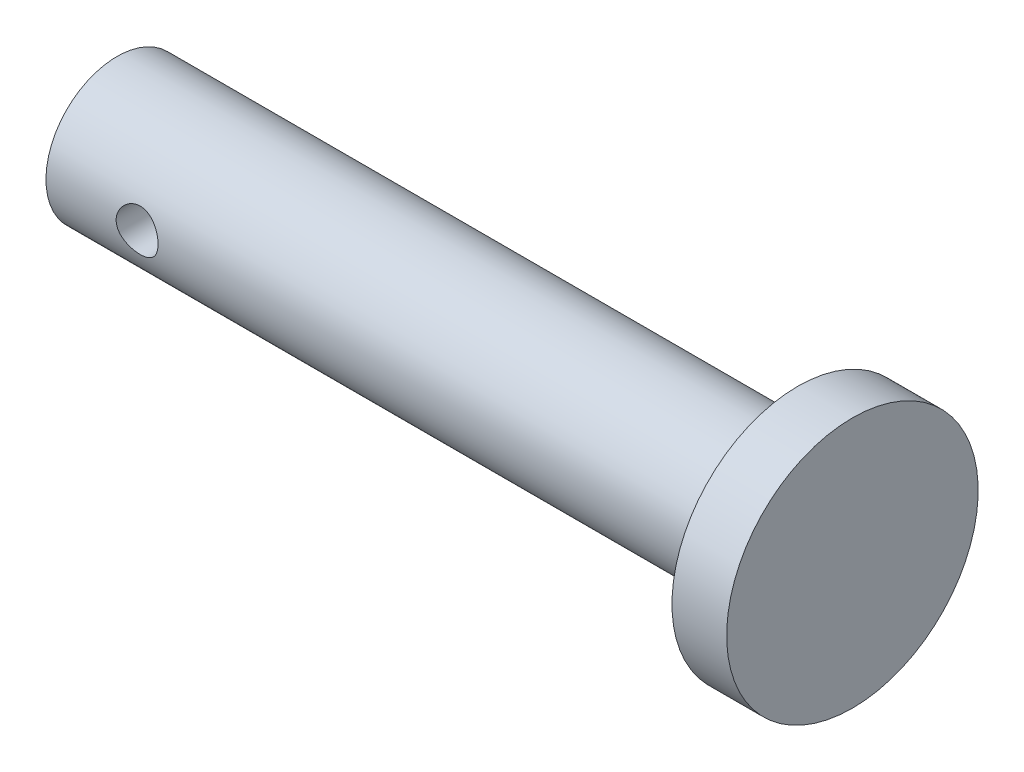
ISO-10303-21;
HEADER;
FILE_DESCRIPTION(('STEP AP214'),'2;1');
FILE_NAME('part.step','',(''),(''),'','','');
FILE_SCHEMA(('AUTOMOTIVE_DESIGN { 1 0 10303 214 1 1 1 1 }'));
ENDSEC;
DATA;
#1=APPLICATION_CONTEXT('core data for automotive mechanical design processes');
#2=APPLICATION_PROTOCOL_DEFINITION('international standard','automotive_design',2000,#1);
#3=PRODUCT_CONTEXT('',#1,'mechanical');
#4=PRODUCT('Part','Part','',(#3));
#5=PRODUCT_RELATED_PRODUCT_CATEGORY('part','',(#4));
#6=PRODUCT_DEFINITION_FORMATION('','',#4);
#7=PRODUCT_DEFINITION_CONTEXT('part definition',#1,'design');
#8=PRODUCT_DEFINITION('design','',#6,#7);
#9=PRODUCT_DEFINITION_SHAPE('','',#8);
#10=(LENGTH_UNIT() NAMED_UNIT(*) SI_UNIT(.MILLI.,.METRE.));
#11=(NAMED_UNIT(*) PLANE_ANGLE_UNIT() SI_UNIT($,.RADIAN.));
#12=(NAMED_UNIT(*) SI_UNIT($,.STERADIAN.) SOLID_ANGLE_UNIT());
#13=UNCERTAINTY_MEASURE_WITH_UNIT(LENGTH_MEASURE(1.E-05),#10,'distance_accuracy_value','');
#14=(GEOMETRIC_REPRESENTATION_CONTEXT(3) GLOBAL_UNCERTAINTY_ASSIGNED_CONTEXT((#13)) GLOBAL_UNIT_ASSIGNED_CONTEXT((#10,
#11,#12)) REPRESENTATION_CONTEXT('',''));
#15=CARTESIAN_POINT('',(0.,0.,0.));
#16=DIRECTION('',(0.,0.,1.));
#17=DIRECTION('',(1.,0.,0.));
#18=AXIS2_PLACEMENT_3D('',#15,#16,#17);
#19=CARTESIAN_POINT('',(-18.675,0.,0.));
#20=DIRECTION('',(-1.,0.,0.));
#21=DIRECTION('',(0.,-1.,0.));
#22=AXIS2_PLACEMENT_3D('',#19,#20,#21);
#23=PLANE('',#22);
#24=CARTESIAN_POINT('',(-18.675,0.,0.));
#25=DIRECTION('',(-1.,0.,0.));
#26=DIRECTION('',(0.,-1.,0.));
#27=AXIS2_PLACEMENT_3D('',#24,#25,#26);
#28=CIRCLE('',#27,3.9);
#29=CARTESIAN_POINT('',(-18.675,-3.9,0.));
#30=VERTEX_POINT('',#29);
#31=EDGE_CURVE('E12',#30,#30,#28,.T.);
#32=ORIENTED_EDGE('',*,*,#31,.T.);
#33=EDGE_LOOP('',(#32));
#34=FACE_BOUND('',#33,.T.);
#35=ADVANCED_FACE('F51',(#34),#23,.T.);
#36=CARTESIAN_POINT('',(-18.675,0.,0.));
#37=DIRECTION('',(-1.,0.,0.));
#38=DIRECTION('',(0.,-1.,0.));
#39=AXIS2_PLACEMENT_3D('',#36,#37,#38);
#40=CYLINDRICAL_SURFACE('',#39,3.9);
#41=CARTESIAN_POINT('',(-12.525,0.,-3.9));
#42=CARTESIAN_POINT('',(-12.5250008968316,-0.0631374782315801,-3.89999937647246));
#43=CARTESIAN_POINT('',(-12.5302168498043,-0.1262840563774,-3.89845206413463));
#44=CARTESIAN_POINT('',(-12.5508953722315,-0.250741476835077,-3.89243053997196));
#45=CARTESIAN_POINT('',(-12.5663612954919,-0.312051711427401,-3.88795537015381));
#46=CARTESIAN_POINT('',(-12.606980772424,-0.431023152180485,-3.87656906770976));
#47=CARTESIAN_POINT('',(-12.6321203177736,-0.488689495108532,-3.86966145870838));
#48=CARTESIAN_POINT('',(-12.6913168464166,-0.598988339996717,-3.85413015735305));
#49=CARTESIAN_POINT('',(-12.7253749253311,-0.651620222399713,-3.84550625418759));
#50=CARTESIAN_POINT('',(-12.8024409145422,-0.75182102249986,-3.82719564289787));
#51=CARTESIAN_POINT('',(-12.8456517308289,-0.799229996730766,-3.81748771569521));
#52=CARTESIAN_POINT('',(-12.9393639463116,-0.886244437812663,-3.79823128727195));
#53=CARTESIAN_POINT('',(-12.9898665202255,-0.925848644862781,-3.78868281201646));
#54=CARTESIAN_POINT('',(-13.098069604138,-0.996960920412011,-3.77060314442044));
#55=CARTESIAN_POINT('',(-13.1559020536166,-1.02827558268509,-3.76209838789334));
#56=CARTESIAN_POINT('',(-13.2763032756927,-1.08067034920287,-3.74738541998928));
#57=CARTESIAN_POINT('',(-13.3388709505136,-1.10175281724697,-3.7411766782754));
#58=CARTESIAN_POINT('',(-13.4651742702842,-1.13251140043501,-3.73197951302094));
#59=CARTESIAN_POINT('',(-13.5288320980852,-1.14248162784549,-3.72890824283298));
#60=CARTESIAN_POINT('',(-13.6569852898076,-1.15165090337876,-3.72608712458471));
#61=CARTESIAN_POINT('',(-13.7214804550077,-1.15085246212836,-3.72633650234237));
#62=CARTESIAN_POINT('',(-13.847101756818,-1.13873847302781,-3.73005496042293));
#63=CARTESIAN_POINT('',(-13.9082670909178,-1.12778930476266,-3.73341187148709));
#64=CARTESIAN_POINT('',(-14.0278510400984,-1.09627578796794,-3.7427859905035));
#65=CARTESIAN_POINT('',(-14.0862693918104,-1.07571051954829,-3.74880345296496));
#66=CARTESIAN_POINT('',(-14.1996066435939,-1.02527418871665,-3.76291161584599));
#67=CARTESIAN_POINT('',(-14.2544685386195,-0.995282774015666,-3.77102887461452));
#68=CARTESIAN_POINT('',(-14.3585046138267,-0.926929185445069,-3.7884090133638));
#69=CARTESIAN_POINT('',(-14.4076774518711,-0.888565042454943,-3.79767216261577));
#70=CARTESIAN_POINT('',(-14.5010201771127,-0.802726738929585,-3.81675721782381));
#71=CARTESIAN_POINT('',(-14.5449088431565,-0.754947925319673,-3.82658660290396));
#72=CARTESIAN_POINT('',(-14.6241150058416,-0.652586172592414,-3.84536541487498));
#73=CARTESIAN_POINT('',(-14.6594319988326,-0.598002833943187,-3.85431479004029));
#74=CARTESIAN_POINT('',(-14.7206553049053,-0.483082586554351,-3.87040231728269));
#75=CARTESIAN_POINT('',(-14.7465010912981,-0.422711680191325,-3.87752873514172));
#76=CARTESIAN_POINT('',(-14.787590357054,-0.298221428159156,-3.88908284633983));
#77=CARTESIAN_POINT('',(-14.8028366895819,-0.234103096265121,-3.89351126588735));
#78=CARTESIAN_POINT('',(-14.8218303833929,-0.106330274604508,-3.89905635830308));
#79=CARTESIAN_POINT('',(-14.8259590646657,-0.0427371473976157,-3.90028280753208));
#80=CARTESIAN_POINT('',(-14.8236665138623,0.0842365312209821,-3.89960679434886));
#81=CARTESIAN_POINT('',(-14.8172466378782,0.147617108907844,-3.89770473412873));
#82=CARTESIAN_POINT('',(-14.7943483396063,0.270939904685514,-3.89105714923803));
#83=CARTESIAN_POINT('',(-14.7780911043642,0.330926882810402,-3.88637419327162));
#84=CARTESIAN_POINT('',(-14.7362441925676,0.447310049477916,-3.87470480893401));
#85=CARTESIAN_POINT('',(-14.7106534086169,0.503705811001051,-3.86771810724012));
#86=CARTESIAN_POINT('',(-14.6502150905663,0.612721454601223,-3.8519704746757));
#87=CARTESIAN_POINT('',(-14.6151713598495,0.665227146489711,-3.84317300308412));
#88=CARTESIAN_POINT('',(-14.5370615860421,0.763743255455843,-3.8248152332649));
#89=CARTESIAN_POINT('',(-14.4939935992274,0.80975209403694,-3.81525475053371));
#90=CARTESIAN_POINT('',(-14.3992676132904,0.895636304747585,-3.7960298269253));
#91=CARTESIAN_POINT('',(-14.3473617261096,0.93524065158333,-3.7863734586898));
#92=CARTESIAN_POINT('',(-14.2374313450957,1.00519385423065,-3.76840740705703));
#93=CARTESIAN_POINT('',(-14.179407032877,1.03554298466269,-3.76009768370557));
#94=CARTESIAN_POINT('',(-14.0590937160704,1.08591088927195,-3.74586217719055));
#95=CARTESIAN_POINT('',(-13.9968274427931,1.10598046799836,-3.73992470237802));
#96=CARTESIAN_POINT('',(-13.8695926533263,1.13529378705524,-3.73113209936963));
#97=CARTESIAN_POINT('',(-13.8046250307892,1.14454107853738,-3.72827596010935));
#98=CARTESIAN_POINT('',(-13.6766404101873,1.15171156470793,-3.72606666169847));
#99=CARTESIAN_POINT('',(-13.6136501288788,1.15007550141294,-3.7265771569012));
#100=CARTESIAN_POINT('',(-13.4888855215509,1.13657300584075,-3.73071716639397));
#101=CARTESIAN_POINT('',(-13.4271111499653,1.12470695768139,-3.73434656357474));
#102=CARTESIAN_POINT('',(-13.3072255716215,1.09136145575474,-3.74422555432673));
#103=CARTESIAN_POINT('',(-13.249080221795,1.06999494893524,-3.75044431044196));
#104=CARTESIAN_POINT('',(-13.1371533015327,1.01834271032695,-3.76479659206304));
#105=CARTESIAN_POINT('',(-13.0833725464559,0.988055316878852,-3.7729304742354));
#106=CARTESIAN_POINT('',(-12.9796466434408,0.918167414296003,-3.79055524386233));
#107=CARTESIAN_POINT('',(-12.9299041336743,0.878275681014946,-3.8000839211764));
#108=CARTESIAN_POINT('',(-12.8376763556955,0.790840400324018,-3.81923701348264));
#109=CARTESIAN_POINT('',(-12.7951929543141,0.743294890673285,-3.82886145243051));
#110=CARTESIAN_POINT('',(-12.7175099884599,0.640302818942885,-3.84744359812366));
#111=CARTESIAN_POINT('',(-12.6825468129365,0.584672772834722,-3.85637519876255));
#112=CARTESIAN_POINT('',(-12.6225198156866,0.468060579348602,-3.87225679535396));
#113=CARTESIAN_POINT('',(-12.5974510765133,0.407081109052212,-3.87920777517854));
#114=CARTESIAN_POINT('',(-12.5603397555691,0.288818906202192,-3.88969020624806));
#115=CARTESIAN_POINT('',(-12.5471223925053,0.231929447719438,-3.89352505905264));
#116=CARTESIAN_POINT('',(-12.5294527768816,0.116695766386291,-3.89868004994844));
#117=CARTESIAN_POINT('',(-12.5249991711467,0.0583517695341206,-3.90000057626526));
#118=CARTESIAN_POINT('',(-12.525,0.,-3.9));
#119=B_SPLINE_CURVE_WITH_KNOTS('',3,(#41,#42,#43,#44,#45,#46,#47,#48,#49,#50,#51,#52,#53,#54,
#55,#56,#57,#58,#59,#60,#61,#62,#63,#64,#65,#66,#67,#68,#69,#70,#71,#72,#73,#74,#75,#76,#77,#78,
#79,#80,#81,#82,#83,#84,#85,#86,#87,#88,#89,#90,#91,#92,#93,#94,#95,#96,#97,#98,#99,#100,#101,
#102,#103,#104,#105,#106,#107,#108,#109,#110,#111,#112,#113,#114,#115,#116,#117,#118),
.UNSPECIFIED.,.T.,.F.,(4,2,2,2,2,2,2,2,2,2,2,2,2,2,2,2,2,2,2,2,2,2,2,2,2,2,2,2,2,2,2,2,2,2,2,2,
2,2,4),(0.,0.189198152270444,0.378458241050166,0.567445288438785,0.756455563349068,
0.950202743995578,1.14398117263433,1.34194624069882,1.53986555389362,1.73241193352215,
1.92491342331717,2.11072647022677,2.2965572959196,2.48486440358068,2.67321584562403,
2.86915241171192,3.06510048775939,3.26227980916675,3.4594060331996,3.64967944633797,
3.83992840039078,4.02605091156304,4.21219551277049,4.40254847143273,4.59294759958346,
4.79001055760107,4.98706766780436,5.18314123176826,5.37915043943247,5.56727160466128,
5.75538570658066,5.94132082860648,6.1272906059795,6.31983061166789,6.51242005874601,
6.71038475402325,6.90825093834658,7.08313521201907,7.25799248042426),.UNSPECIFIED.);
#120=CARTESIAN_POINT('',(-12.525,0.,-3.9));
#121=VERTEX_POINT('',#120);
#122=EDGE_CURVE('E58',#121,#121,#119,.T.);
#123=ORIENTED_EDGE('',*,*,#122,.F.);
#124=EDGE_LOOP('',(#123));
#125=FACE_BOUND('',#124,.T.);
#126=CARTESIAN_POINT('',(-12.525,0.,3.90000000000001));
#127=CARTESIAN_POINT('',(-12.5250008968316,0.0631374782315817,3.89999937647246));
#128=CARTESIAN_POINT('',(-12.5302168498043,0.126284056377401,3.89845206413463));
#129=CARTESIAN_POINT('',(-12.5508953722315,0.250741476835078,3.89243053997195));
#130=CARTESIAN_POINT('',(-12.5663612954919,0.312051711427403,3.88795537015381));
#131=CARTESIAN_POINT('',(-12.606980772424,0.431023152180487,3.87656906770976));
#132=CARTESIAN_POINT('',(-12.6321203177736,0.488689495108533,3.86966145870838));
#133=CARTESIAN_POINT('',(-12.6913168464166,0.598988339996719,3.85413015735305));
#134=CARTESIAN_POINT('',(-12.7253749253311,0.651620222399714,3.84550625418759));
#135=CARTESIAN_POINT('',(-12.8024409145422,0.75182102249986,3.82719564289787));
#136=CARTESIAN_POINT('',(-12.8456517308289,0.799229996730766,3.81748771569521));
#137=CARTESIAN_POINT('',(-12.9393639463116,0.886244437812663,3.79823128727195));
#138=CARTESIAN_POINT('',(-12.9898665202255,0.925848644862782,3.78868281201646));
#139=CARTESIAN_POINT('',(-13.098069604138,0.996960920412012,3.77060314442044));
#140=CARTESIAN_POINT('',(-13.1559020536166,1.0282755826851,3.76209838789334));
#141=CARTESIAN_POINT('',(-13.2763032756927,1.08067034920287,3.74738541998928));
#142=CARTESIAN_POINT('',(-13.3388709505136,1.10175281724697,3.7411766782754));
#143=CARTESIAN_POINT('',(-13.4651742702842,1.13251140043501,3.73197951302094));
#144=CARTESIAN_POINT('',(-13.5288320980852,1.14248162784549,3.72890824283298));
#145=CARTESIAN_POINT('',(-13.6569852898076,1.15165090337876,3.72608712458471));
#146=CARTESIAN_POINT('',(-13.7214804550077,1.15085246212836,3.72633650234237));
#147=CARTESIAN_POINT('',(-13.847101756818,1.13873847302781,3.73005496042293));
#148=CARTESIAN_POINT('',(-13.9082670909178,1.12778930476266,3.73341187148709));
#149=CARTESIAN_POINT('',(-14.0278510400984,1.09627578796794,3.7427859905035));
#150=CARTESIAN_POINT('',(-14.0862693918104,1.07571051954829,3.74880345296496));
#151=CARTESIAN_POINT('',(-14.1996066435939,1.02527418871665,3.76291161584599));
#152=CARTESIAN_POINT('',(-14.2544685386195,0.995282774015666,3.77102887461452));
#153=CARTESIAN_POINT('',(-14.3585046138267,0.926929185445069,3.78840901336381));
#154=CARTESIAN_POINT('',(-14.4076774518711,0.888565042454942,3.79767216261577));
#155=CARTESIAN_POINT('',(-14.5010201771127,0.802726738929583,3.81675721782382));
#156=CARTESIAN_POINT('',(-14.5449088431565,0.754947925319672,3.82658660290396));
#157=CARTESIAN_POINT('',(-14.6241150058416,0.652586172592413,3.84536541487498));
#158=CARTESIAN_POINT('',(-14.6594319988326,0.598002833943185,3.85431479004029));
#159=CARTESIAN_POINT('',(-14.7206553049053,0.483082586554348,3.87040231728269));
#160=CARTESIAN_POINT('',(-14.7465010912981,0.422711680191323,3.87752873514172));
#161=CARTESIAN_POINT('',(-14.787590357054,0.298221428159155,3.88908284633983));
#162=CARTESIAN_POINT('',(-14.8028366895819,0.23410309626512,3.89351126588736));
#163=CARTESIAN_POINT('',(-14.8218303833929,0.106330274604507,3.89905635830308));
#164=CARTESIAN_POINT('',(-14.8259590646657,0.0427371473976144,3.90028280753208));
#165=CARTESIAN_POINT('',(-14.8236665138623,-0.0842365312209835,3.89960679434886));
#166=CARTESIAN_POINT('',(-14.8172466378782,-0.147617108907845,3.89770473412873));
#167=CARTESIAN_POINT('',(-14.7943483396063,-0.270939904685516,3.89105714923803));
#168=CARTESIAN_POINT('',(-14.7780911043642,-0.330926882810404,3.88637419327162));
#169=CARTESIAN_POINT('',(-14.7362441925676,-0.447310049477918,3.87470480893401));
#170=CARTESIAN_POINT('',(-14.7106534086169,-0.503705811001053,3.86771810724011));
#171=CARTESIAN_POINT('',(-14.6502150905663,-0.612721454601224,3.8519704746757));
#172=CARTESIAN_POINT('',(-14.6151713598495,-0.665227146489712,3.84317300308412));
#173=CARTESIAN_POINT('',(-14.5370615860421,-0.763743255455844,3.8248152332649));
#174=CARTESIAN_POINT('',(-14.4939935992274,-0.809752094036941,3.81525475053371));
#175=CARTESIAN_POINT('',(-14.3992676132904,-0.895636304747585,3.79602982692529));
#176=CARTESIAN_POINT('',(-14.3473617261096,-0.93524065158333,3.7863734586898));
#177=CARTESIAN_POINT('',(-14.2374313450957,-1.00519385423065,3.76840740705703));
#178=CARTESIAN_POINT('',(-14.179407032877,-1.03554298466269,3.76009768370557));
#179=CARTESIAN_POINT('',(-14.0590937160704,-1.08591088927195,3.74586217719055));
#180=CARTESIAN_POINT('',(-13.9968274427931,-1.10598046799836,3.73992470237802));
#181=CARTESIAN_POINT('',(-13.8695926533263,-1.13529378705524,3.73113209936963));
#182=CARTESIAN_POINT('',(-13.8046250307892,-1.14454107853738,3.72827596010935));
#183=CARTESIAN_POINT('',(-13.6766404101873,-1.15171156470793,3.72606666169847));
#184=CARTESIAN_POINT('',(-13.6136501288788,-1.15007550141294,3.7265771569012));
#185=CARTESIAN_POINT('',(-13.4888855215509,-1.13657300584075,3.73071716639397));
#186=CARTESIAN_POINT('',(-13.4271111499653,-1.12470695768139,3.73434656357474));
#187=CARTESIAN_POINT('',(-13.3072255716215,-1.09136145575474,3.74422555432673));
#188=CARTESIAN_POINT('',(-13.249080221795,-1.06999494893524,3.75044431044196));
#189=CARTESIAN_POINT('',(-13.1371533015327,-1.01834271032695,3.76479659206304));
#190=CARTESIAN_POINT('',(-13.0833725464559,-0.988055316878852,3.7729304742354));
#191=CARTESIAN_POINT('',(-12.9796466434408,-0.918167414296003,3.79055524386233));
#192=CARTESIAN_POINT('',(-12.9299041336743,-0.878275681014944,3.8000839211764));
#193=CARTESIAN_POINT('',(-12.8376763556954,-0.790840400324015,3.81923701348264));
#194=CARTESIAN_POINT('',(-12.7951929543141,-0.743294890673283,3.82886145243051));
#195=CARTESIAN_POINT('',(-12.7175099884599,-0.640302818942883,3.84744359812366));
#196=CARTESIAN_POINT('',(-12.6825468129365,-0.58467277283472,3.85637519876255));
#197=CARTESIAN_POINT('',(-12.6225198156866,-0.4680605793486,3.87225679535396));
#198=CARTESIAN_POINT('',(-12.5974510765133,-0.40708110905221,3.87920777517854));
#199=CARTESIAN_POINT('',(-12.5603397555691,-0.288818906202189,3.88969020624806));
#200=CARTESIAN_POINT('',(-12.5471223925053,-0.231929447719435,3.89352505905264));
#201=CARTESIAN_POINT('',(-12.5294527768816,-0.116695766386288,3.89868004994844));
#202=CARTESIAN_POINT('',(-12.5249991711467,-0.0583517695341184,3.90000057626527));
#203=CARTESIAN_POINT('',(-12.525,0.,3.90000000000001));
#204=B_SPLINE_CURVE_WITH_KNOTS('',3,(#126,#127,#128,#129,#130,#131,#132,#133,#134,#135,#136,
#137,#138,#139,#140,#141,#142,#143,#144,#145,#146,#147,#148,#149,#150,#151,#152,#153,#154,#155,
#156,#157,#158,#159,#160,#161,#162,#163,#164,#165,#166,#167,#168,#169,#170,#171,#172,#173,#174,
#175,#176,#177,#178,#179,#180,#181,#182,#183,#184,#185,#186,#187,#188,#189,#190,#191,#192,#193,
#194,#195,#196,#197,#198,#199,#200,#201,#202,#203),.UNSPECIFIED.,.T.,.F.,(4,2,2,2,2,2,2,2,2,2,2,
2,2,2,2,2,2,2,2,2,2,2,2,2,2,2,2,2,2,2,2,2,2,2,2,2,2,2,4),(0.,0.189198152270444,
0.378458241050166,0.567445288438786,0.756455563349067,0.950202743995577,1.14398117263433,
1.34194624069882,1.53986555389362,1.73241193352215,1.92491342331717,2.11072647022676,
2.2965572959196,2.48486440358068,2.67321584562403,2.86915241171192,3.06510048775939,
3.26227980916675,3.4594060331996,3.64967944633797,3.83992840039078,4.02605091156304,
4.21219551277049,4.40254847143273,4.59294759958346,4.79001055760106,4.98706766780435,
5.18314123176826,5.37915043943247,5.56727160466128,5.75538570658066,5.94132082860647,
6.1272906059795,6.3198306116679,6.51242005874601,6.71038475402325,6.90825093834658,
7.08313521201907,7.25799248042426),.UNSPECIFIED.);
#205=CARTESIAN_POINT('',(-12.525,0.,3.90000000000001));
#206=VERTEX_POINT('',#205);
#207=EDGE_CURVE('E63',#206,#206,#204,.T.);
#208=ORIENTED_EDGE('',*,*,#207,.F.);
#209=EDGE_LOOP('',(#208));
#210=FACE_BOUND('',#209,.T.);
#211=CARTESIAN_POINT('',(18.675,0.,0.));
#212=DIRECTION('',(-1.,0.,0.));
#213=DIRECTION('',(0.,-1.,0.));
#214=AXIS2_PLACEMENT_3D('',#211,#212,#213);
#215=CIRCLE('',#214,3.90000000000001);
#216=CARTESIAN_POINT('',(18.675,-3.89999999999999,0.));
#217=VERTEX_POINT('',#216);
#218=EDGE_CURVE('E69',#217,#217,#215,.T.);
#219=ORIENTED_EDGE('',*,*,#218,.T.);
#220=EDGE_LOOP('',(#219));
#221=FACE_BOUND('',#220,.T.);
#222=ORIENTED_EDGE('',*,*,#31,.F.);
#223=EDGE_LOOP('',(#222));
#224=FACE_BOUND('',#223,.T.);
#225=ADVANCED_FACE('F79',(#125,#210,#221,#224),#40,.T.);
#226=CARTESIAN_POINT('',(-13.675,0.,-3.90000000000001));
#227=DIRECTION('',(0.,0.,1.));
#228=DIRECTION('',(1.,0.,0.));
#229=AXIS2_PLACEMENT_3D('',#226,#227,#228);
#230=CYLINDRICAL_SURFACE('',#229,1.15);
#231=ORIENTED_EDGE('',*,*,#122,.T.);
#232=EDGE_LOOP('',(#231));
#233=FACE_BOUND('',#232,.T.);
#234=ORIENTED_EDGE('',*,*,#207,.T.);
#235=EDGE_LOOP('',(#234));
#236=FACE_BOUND('',#235,.T.);
#237=ADVANCED_FACE('F81',(#233,#236),#230,.F.);
#238=CARTESIAN_POINT('',(21.675,0.,0.));
#239=DIRECTION('',(-1.,0.,0.));
#240=DIRECTION('',(0.,-1.,0.));
#241=AXIS2_PLACEMENT_3D('',#238,#239,#240);
#242=CYLINDRICAL_SURFACE('',#241,6.90000000000001);
#243=CARTESIAN_POINT('',(21.675,0.,0.));
#244=DIRECTION('',(1.,0.,0.));
#245=DIRECTION('',(0.,1.,0.));
#246=AXIS2_PLACEMENT_3D('',#243,#244,#245);
#247=CIRCLE('',#246,6.90000000000001);
#248=CARTESIAN_POINT('',(21.675,6.90000000000003,0.));
#249=VERTEX_POINT('',#248);
#250=EDGE_CURVE('E114',#249,#249,#247,.T.);
#251=ORIENTED_EDGE('',*,*,#250,.F.);
#252=EDGE_LOOP('',(#251));
#253=FACE_BOUND('',#252,.T.);
#254=CARTESIAN_POINT('',(18.675,0.,0.));
#255=DIRECTION('',(1.,0.,0.));
#256=DIRECTION('',(0.,1.,0.));
#257=AXIS2_PLACEMENT_3D('',#254,#255,#256);
#258=CIRCLE('',#257,6.90000000000001);
#259=CARTESIAN_POINT('',(18.675,6.90000000000003,0.));
#260=VERTEX_POINT('',#259);
#261=EDGE_CURVE('E116',#260,#260,#258,.T.);
#262=ORIENTED_EDGE('',*,*,#261,.T.);
#263=EDGE_LOOP('',(#262));
#264=FACE_BOUND('',#263,.T.);
#265=ADVANCED_FACE('F85',(#253,#264),#242,.T.);
#266=CARTESIAN_POINT('',(21.675,0.,0.));
#267=DIRECTION('',(1.,0.,0.));
#268=DIRECTION('',(0.,1.,0.));
#269=AXIS2_PLACEMENT_3D('',#266,#267,#268);
#270=PLANE('',#269);
#271=ORIENTED_EDGE('',*,*,#250,.T.);
#272=EDGE_LOOP('',(#271));
#273=FACE_BOUND('',#272,.T.);
#274=ADVANCED_FACE('F89',(#273),#270,.T.);
#275=CARTESIAN_POINT('',(18.675,0.,0.));
#276=DIRECTION('',(1.,0.,0.));
#277=DIRECTION('',(0.,1.,0.));
#278=AXIS2_PLACEMENT_3D('',#275,#276,#277);
#279=PLANE('',#278);
#280=ORIENTED_EDGE('',*,*,#218,.F.);
#281=EDGE_LOOP('',(#280));
#282=FACE_BOUND('',#281,.T.);
#283=ORIENTED_EDGE('',*,*,#261,.F.);
#284=EDGE_LOOP('',(#283));
#285=FACE_BOUND('',#284,.T.);
#286=ADVANCED_FACE('F91',(#282,#285),#279,.F.);
#287=CLOSED_SHELL('',(#35,#225,#237,#265,#274,#286));
#288=MANIFOLD_SOLID_BREP('B2',#287);
#289=ADVANCED_BREP_SHAPE_REPRESENTATION('',(#18,#288),#14);
#290=SHAPE_DEFINITION_REPRESENTATION(#9,#289);
ENDSEC;
END-ISO-10303-21;
